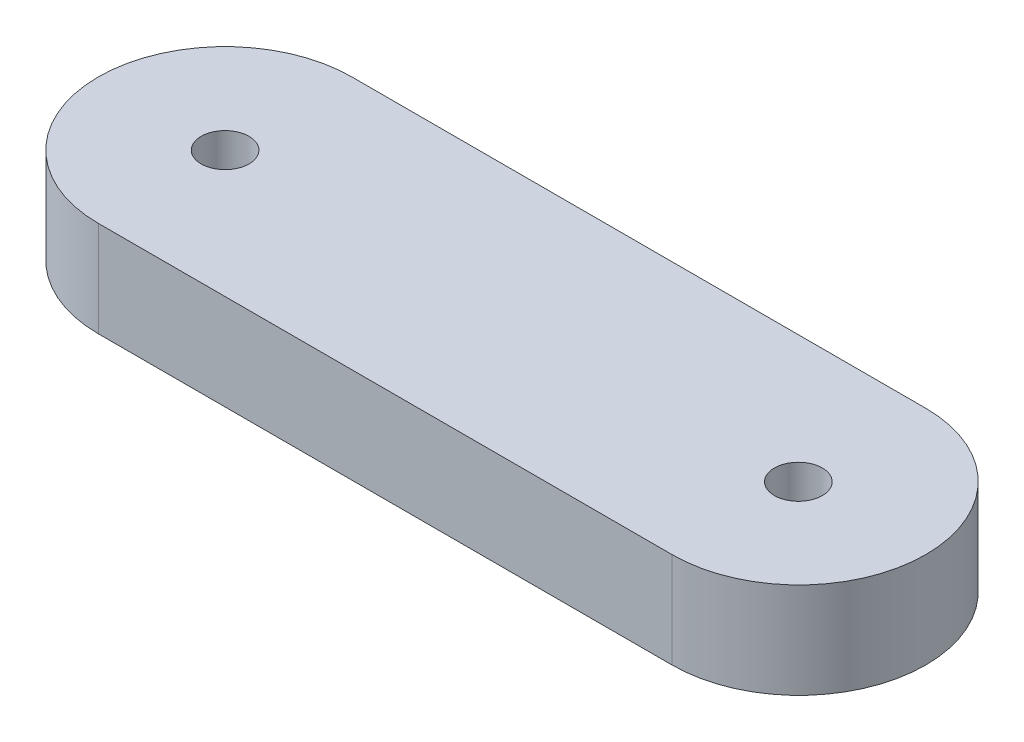
ISO-10303-21;
HEADER;
FILE_DESCRIPTION(('STEP AP214'),'2;1');
FILE_NAME('part.step','',(''),(''),'','','');
FILE_SCHEMA(('AUTOMOTIVE_DESIGN { 1 0 10303 214 1 1 1 1 }'));
ENDSEC;
DATA;
#1=APPLICATION_CONTEXT('core data for automotive mechanical design processes');
#2=APPLICATION_PROTOCOL_DEFINITION('international standard','automotive_design',2000,#1);
#3=PRODUCT_CONTEXT('',#1,'mechanical');
#4=PRODUCT('Part','Part','',(#3));
#5=PRODUCT_RELATED_PRODUCT_CATEGORY('part','',(#4));
#6=PRODUCT_DEFINITION_FORMATION('','',#4);
#7=PRODUCT_DEFINITION_CONTEXT('part definition',#1,'design');
#8=PRODUCT_DEFINITION('design','',#6,#7);
#9=PRODUCT_DEFINITION_SHAPE('','',#8);
#10=(LENGTH_UNIT() NAMED_UNIT(*) SI_UNIT(.MILLI.,.METRE.));
#11=(NAMED_UNIT(*) PLANE_ANGLE_UNIT() SI_UNIT($,.RADIAN.));
#12=(NAMED_UNIT(*) SI_UNIT($,.STERADIAN.) SOLID_ANGLE_UNIT());
#13=UNCERTAINTY_MEASURE_WITH_UNIT(LENGTH_MEASURE(1.E-05),#10,'distance_accuracy_value','');
#14=(GEOMETRIC_REPRESENTATION_CONTEXT(3) GLOBAL_UNCERTAINTY_ASSIGNED_CONTEXT((#13)) GLOBAL_UNIT_ASSIGNED_CONTEXT((#10,
#11,#12)) REPRESENTATION_CONTEXT('',''));
#15=CARTESIAN_POINT('',(0.,0.,0.));
#16=DIRECTION('',(0.,0.,1.));
#17=DIRECTION('',(1.,0.,0.));
#18=AXIS2_PLACEMENT_3D('',#15,#16,#17);
#19=CARTESIAN_POINT('',(-16.4088519542022,6.,6.09914337868322));
#20=DIRECTION('',(0.,1.,0.));
#21=DIRECTION('',(0.,0.,1.));
#22=AXIS2_PLACEMENT_3D('',#19,#20,#21);
#23=PLANE('',#22);
#24=CARTESIAN_POINT('',(19.5911296930118,6.,6.13549444815868));
#25=DIRECTION('',(0.,1.,0.));
#26=DIRECTION('',(0.,0.,1.));
#27=AXIS2_PLACEMENT_3D('',#24,#25,#26);
#28=CIRCLE('',#27,1.50185606528052);
#29=CARTESIAN_POINT('',(19.5911296930118,6.,7.6373505134392));
#30=VERTEX_POINT('',#29);
#31=EDGE_CURVE('E101',#30,#30,#28,.T.);
#32=ORIENTED_EDGE('',*,*,#31,.F.);
#33=EDGE_LOOP('',(#32));
#34=FACE_BOUND('',#33,.T.);
#35=CARTESIAN_POINT('',(-16.4088519542022,6.,6.09914337868322));
#36=DIRECTION('',(0.,1.,0.));
#37=DIRECTION('',(0.,0.,1.));
#38=AXIS2_PLACEMENT_3D('',#35,#36,#37);
#39=CIRCLE('',#38,7.95432054276186);
#40=CARTESIAN_POINT('',(-16.4088519542022,6.,-1.85517716407875));
#41=VERTEX_POINT('',#40);
#42=CARTESIAN_POINT('',(-16.4088519542022,6.,14.053463921445));
#43=VERTEX_POINT('',#42);
#44=EDGE_CURVE('E86',#41,#43,#39,.T.);
#45=ORIENTED_EDGE('',*,*,#44,.T.);
#46=DIRECTION('',(1.,0.,0.));
#47=VECTOR('',#46,1.);
#48=CARTESIAN_POINT('',(-16.4088519542022,6.,14.053463921445));
#49=LINE('',#48,#47);
#50=CARTESIAN_POINT('',(19.5911480447954,6.,14.053463921445));
#51=VERTEX_POINT('',#50);
#52=EDGE_CURVE('E81',#43,#51,#49,.T.);
#53=ORIENTED_EDGE('',*,*,#52,.T.);
#54=CARTESIAN_POINT('',(19.5911480447954,6.,6.09927770648704));
#55=DIRECTION('',(0.,1.,0.));
#56=DIRECTION('',(0.,0.,1.));
#57=AXIS2_PLACEMENT_3D('',#54,#55,#56);
#58=CIRCLE('',#57,7.95418621495793);
#59=CARTESIAN_POINT('',(19.5911480447954,6.,-1.85490850847089));
#60=VERTEX_POINT('',#59);
#61=EDGE_CURVE('E84',#51,#60,#58,.T.);
#62=ORIENTED_EDGE('',*,*,#61,.T.);
#63=DIRECTION('',(-0.999999999972154,0.,-7.46265577382822E-06));
#64=VECTOR('',#63,1.);
#65=CARTESIAN_POINT('',(-16.4088519542022,6.,-1.85517716407875));
#66=LINE('',#65,#64);
#67=EDGE_CURVE('E51',#60,#41,#66,.T.);
#68=ORIENTED_EDGE('',*,*,#67,.T.);
#69=EDGE_LOOP('',(#45,#53,#62,#68));
#70=FACE_BOUND('',#69,.T.);
#71=CARTESIAN_POINT('',(-16.4088519542022,6.,6.09914337868322));
#72=DIRECTION('',(0.,1.,0.));
#73=DIRECTION('',(0.,0.,1.));
#74=AXIS2_PLACEMENT_3D('',#71,#72,#73);
#75=CIRCLE('',#74,1.50185606528058);
#76=CARTESIAN_POINT('',(-16.4088519542022,6.,7.6009994439638));
#77=VERTEX_POINT('',#76);
#78=EDGE_CURVE('E116',#77,#77,#75,.T.);
#79=ORIENTED_EDGE('',*,*,#78,.F.);
#80=EDGE_LOOP('',(#79));
#81=FACE_BOUND('',#80,.T.);
#82=ADVANCED_FACE('F34',(#34,#70,#81),#23,.T.);
#83=CARTESIAN_POINT('',(-16.4088519542022,0.,6.09914337868322));
#84=DIRECTION('',(0.,1.,0.));
#85=DIRECTION('',(0.,0.,1.));
#86=AXIS2_PLACEMENT_3D('',#83,#84,#85);
#87=PLANE('',#86);
#88=CARTESIAN_POINT('',(-16.4088519542022,0.,6.09914337868322));
#89=DIRECTION('',(0.,1.,0.));
#90=DIRECTION('',(0.,0.,1.));
#91=AXIS2_PLACEMENT_3D('',#88,#89,#90);
#92=CIRCLE('',#91,7.95432054276186);
#93=CARTESIAN_POINT('',(-16.4088519542022,0.,-1.85517716407875));
#94=VERTEX_POINT('',#93);
#95=CARTESIAN_POINT('',(-16.4088519542022,0.,14.053463921445));
#96=VERTEX_POINT('',#95);
#97=EDGE_CURVE('E98',#94,#96,#92,.T.);
#98=ORIENTED_EDGE('',*,*,#97,.F.);
#99=DIRECTION('',(-0.999999999972154,0.,-7.46265577382822E-06));
#100=VECTOR('',#99,1.);
#101=CARTESIAN_POINT('',(-16.4088519542022,0.,-1.85517716407875));
#102=LINE('',#101,#100);
#103=CARTESIAN_POINT('',(19.5911480447954,0.,-1.85490850847089));
#104=VERTEX_POINT('',#103);
#105=EDGE_CURVE('E74',#104,#94,#102,.T.);
#106=ORIENTED_EDGE('',*,*,#105,.F.);
#107=CARTESIAN_POINT('',(19.5911480447954,0.,6.09927770648704));
#108=DIRECTION('',(0.,1.,0.));
#109=DIRECTION('',(0.,0.,1.));
#110=AXIS2_PLACEMENT_3D('',#107,#108,#109);
#111=CIRCLE('',#110,7.95418621495793);
#112=CARTESIAN_POINT('',(19.5911480447954,0.,14.053463921445));
#113=VERTEX_POINT('',#112);
#114=EDGE_CURVE('E68',#113,#104,#111,.T.);
#115=ORIENTED_EDGE('',*,*,#114,.F.);
#116=DIRECTION('',(1.,0.,0.));
#117=VECTOR('',#116,1.);
#118=CARTESIAN_POINT('',(-16.4088519542022,0.,14.053463921445));
#119=LINE('',#118,#117);
#120=EDGE_CURVE('E90',#96,#113,#119,.T.);
#121=ORIENTED_EDGE('',*,*,#120,.F.);
#122=EDGE_LOOP('',(#98,#106,#115,#121));
#123=FACE_BOUND('',#122,.T.);
#124=CARTESIAN_POINT('',(19.5911296930118,0.,6.13549444815868));
#125=DIRECTION('',(0.,1.,0.));
#126=DIRECTION('',(0.,0.,1.));
#127=AXIS2_PLACEMENT_3D('',#124,#125,#126);
#128=CIRCLE('',#127,1.50185606528052);
#129=CARTESIAN_POINT('',(19.5911296930118,0.,7.6373505134392));
#130=VERTEX_POINT('',#129);
#131=EDGE_CURVE('E113',#130,#130,#128,.T.);
#132=ORIENTED_EDGE('',*,*,#131,.T.);
#133=EDGE_LOOP('',(#132));
#134=FACE_BOUND('',#133,.T.);
#135=CARTESIAN_POINT('',(-16.4088519542022,0.,6.09914337868322));
#136=DIRECTION('',(0.,1.,0.));
#137=DIRECTION('',(0.,0.,1.));
#138=AXIS2_PLACEMENT_3D('',#135,#136,#137);
#139=CIRCLE('',#138,1.50185606528058);
#140=CARTESIAN_POINT('',(-16.4088519542022,0.,7.6009994439638));
#141=VERTEX_POINT('',#140);
#142=EDGE_CURVE('E119',#141,#141,#139,.T.);
#143=ORIENTED_EDGE('',*,*,#142,.T.);
#144=EDGE_LOOP('',(#143));
#145=FACE_BOUND('',#144,.T.);
#146=ADVANCED_FACE('F109',(#123,#134,#145),#87,.F.);
#147=CARTESIAN_POINT('',(-16.4088519542022,6.,6.09914337868322));
#148=DIRECTION('',(0.,-1.,0.));
#149=DIRECTION('',(0.,0.,-1.));
#150=AXIS2_PLACEMENT_3D('',#147,#148,#149);
#151=CYLINDRICAL_SURFACE('',#150,7.95432054276186);
#152=ORIENTED_EDGE('',*,*,#97,.T.);
#153=DIRECTION('',(0.,-1.,0.));
#154=VECTOR('',#153,1.);
#155=CARTESIAN_POINT('',(-16.4088519542022,6.,14.053463921445));
#156=LINE('',#155,#154);
#157=EDGE_CURVE('E11',#43,#96,#156,.T.);
#158=ORIENTED_EDGE('',*,*,#157,.F.);
#159=ORIENTED_EDGE('',*,*,#44,.F.);
#160=DIRECTION('',(0.,-1.,0.));
#161=VECTOR('',#160,1.);
#162=CARTESIAN_POINT('',(-16.4088519542022,6.,-1.85517716407875));
#163=LINE('',#162,#161);
#164=EDGE_CURVE('E94',#41,#94,#163,.T.);
#165=ORIENTED_EDGE('',*,*,#164,.T.);
#166=EDGE_LOOP('',(#152,#158,#159,#165));
#167=FACE_BOUND('',#166,.T.);
#168=ADVANCED_FACE('F36',(#167),#151,.T.);
#169=CARTESIAN_POINT('',(-16.4088519542022,6.,14.053463921445));
#170=DIRECTION('',(0.,0.,-1.));
#171=DIRECTION('',(-1.,0.,0.));
#172=AXIS2_PLACEMENT_3D('',#169,#170,#171);
#173=PLANE('',#172);
#174=ORIENTED_EDGE('',*,*,#120,.T.);
#175=DIRECTION('',(0.,-1.,0.));
#176=VECTOR('',#175,1.);
#177=CARTESIAN_POINT('',(19.5911480447954,6.,14.053463921445));
#178=LINE('',#177,#176);
#179=EDGE_CURVE('E43',#51,#113,#178,.T.);
#180=ORIENTED_EDGE('',*,*,#179,.F.);
#181=ORIENTED_EDGE('',*,*,#52,.F.);
#182=ORIENTED_EDGE('',*,*,#157,.T.);
#183=EDGE_LOOP('',(#174,#180,#181,#182));
#184=FACE_BOUND('',#183,.T.);
#185=ADVANCED_FACE('F89',(#184),#173,.F.);
#186=CARTESIAN_POINT('',(19.5911480447954,6.,6.09927770648704));
#187=DIRECTION('',(0.,-1.,0.));
#188=DIRECTION('',(0.,0.,-1.));
#189=AXIS2_PLACEMENT_3D('',#186,#187,#188);
#190=CYLINDRICAL_SURFACE('',#189,7.95418621495793);
#191=ORIENTED_EDGE('',*,*,#114,.T.);
#192=DIRECTION('',(0.,-1.,0.));
#193=VECTOR('',#192,1.);
#194=CARTESIAN_POINT('',(19.5911480447954,6.,-1.85490850847089));
#195=LINE('',#194,#193);
#196=EDGE_CURVE('E91',#60,#104,#195,.T.);
#197=ORIENTED_EDGE('',*,*,#196,.F.);
#198=ORIENTED_EDGE('',*,*,#61,.F.);
#199=ORIENTED_EDGE('',*,*,#179,.T.);
#200=EDGE_LOOP('',(#191,#197,#198,#199));
#201=FACE_BOUND('',#200,.T.);
#202=ADVANCED_FACE('F92',(#201),#190,.T.);
#203=CARTESIAN_POINT('',(-16.4088519542022,6.,-1.85517716407875));
#204=DIRECTION('',(-7.46265577382821E-06,0.,0.999999999972154));
#205=DIRECTION('',(0.999999999972154,0.,7.46265577382822E-06));
#206=AXIS2_PLACEMENT_3D('',#203,#204,#205);
#207=PLANE('',#206);
#208=ORIENTED_EDGE('',*,*,#105,.T.);
#209=ORIENTED_EDGE('',*,*,#164,.F.);
#210=ORIENTED_EDGE('',*,*,#67,.F.);
#211=ORIENTED_EDGE('',*,*,#196,.T.);
#212=EDGE_LOOP('',(#208,#209,#210,#211));
#213=FACE_BOUND('',#212,.T.);
#214=ADVANCED_FACE('F106',(#213),#207,.F.);
#215=CARTESIAN_POINT('',(19.5911296930118,6.,6.13549444815868));
#216=DIRECTION('',(0.,-1.,0.));
#217=DIRECTION('',(0.,0.,-1.));
#218=AXIS2_PLACEMENT_3D('',#215,#216,#217);
#219=CYLINDRICAL_SURFACE('',#218,1.50185606528052);
#220=ORIENTED_EDGE('',*,*,#31,.T.);
#221=EDGE_LOOP('',(#220));
#222=FACE_BOUND('',#221,.T.);
#223=ORIENTED_EDGE('',*,*,#131,.F.);
#224=EDGE_LOOP('',(#223));
#225=FACE_BOUND('',#224,.T.);
#226=ADVANCED_FACE('F136',(#222,#225),#219,.F.);
#227=CARTESIAN_POINT('',(-16.4088519542022,6.,6.09914337868322));
#228=DIRECTION('',(0.,-1.,0.));
#229=DIRECTION('',(0.,0.,-1.));
#230=AXIS2_PLACEMENT_3D('',#227,#228,#229);
#231=CYLINDRICAL_SURFACE('',#230,1.50185606528058);
#232=ORIENTED_EDGE('',*,*,#78,.T.);
#233=EDGE_LOOP('',(#232));
#234=FACE_BOUND('',#233,.T.);
#235=ORIENTED_EDGE('',*,*,#142,.F.);
#236=EDGE_LOOP('',(#235));
#237=FACE_BOUND('',#236,.T.);
#238=ADVANCED_FACE('F125',(#234,#237),#231,.F.);
#239=CLOSED_SHELL('',(#82,#146,#168,#185,#202,#214,#226,#238));
#240=MANIFOLD_SOLID_BREP('B2',#239);
#241=ADVANCED_BREP_SHAPE_REPRESENTATION('',(#18,#240),#14);
#242=SHAPE_DEFINITION_REPRESENTATION(#9,#241);
ENDSEC;
END-ISO-10303-21;
